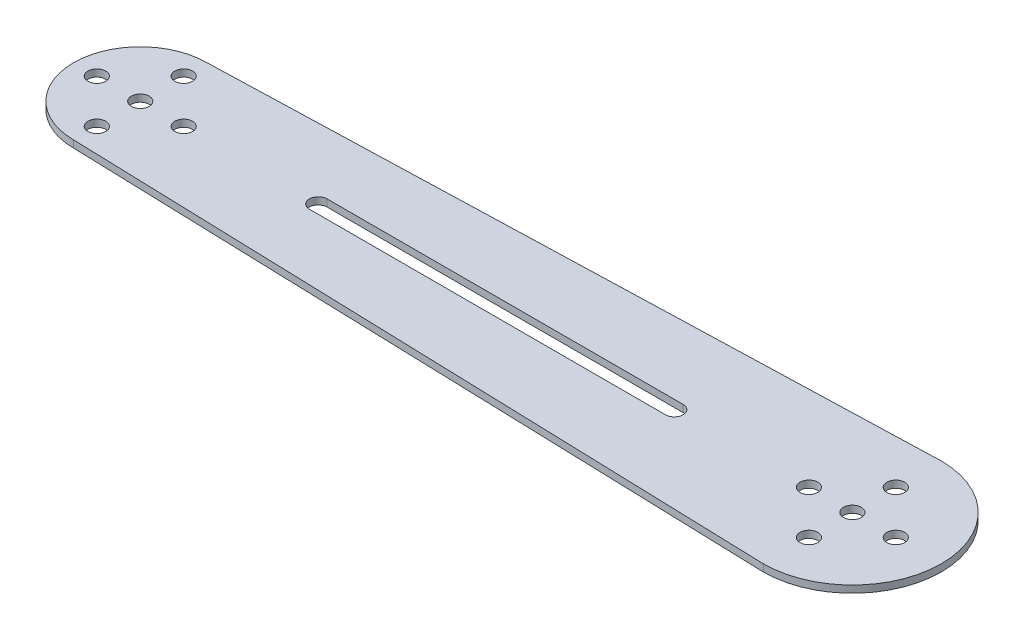
ISO-10303-21;
HEADER;
FILE_DESCRIPTION(('STEP AP214'),'2;1');
FILE_NAME('part.step','',(''),(''),'','','');
FILE_SCHEMA(('AUTOMOTIVE_DESIGN { 1 0 10303 214 1 1 1 1 }'));
ENDSEC;
DATA;
#1=APPLICATION_CONTEXT('core data for automotive mechanical design processes');
#2=APPLICATION_PROTOCOL_DEFINITION('international standard','automotive_design',2000,#1);
#3=PRODUCT_CONTEXT('',#1,'mechanical');
#4=PRODUCT('Part','Part','',(#3));
#5=PRODUCT_RELATED_PRODUCT_CATEGORY('part','',(#4));
#6=PRODUCT_DEFINITION_FORMATION('','',#4);
#7=PRODUCT_DEFINITION_CONTEXT('part definition',#1,'design');
#8=PRODUCT_DEFINITION('design','',#6,#7);
#9=PRODUCT_DEFINITION_SHAPE('','',#8);
#10=(LENGTH_UNIT() NAMED_UNIT(*) SI_UNIT(.MILLI.,.METRE.));
#11=(NAMED_UNIT(*) PLANE_ANGLE_UNIT() SI_UNIT($,.RADIAN.));
#12=(NAMED_UNIT(*) SI_UNIT($,.STERADIAN.) SOLID_ANGLE_UNIT());
#13=UNCERTAINTY_MEASURE_WITH_UNIT(LENGTH_MEASURE(1.E-05),#10,'distance_accuracy_value','');
#14=(GEOMETRIC_REPRESENTATION_CONTEXT(3) GLOBAL_UNCERTAINTY_ASSIGNED_CONTEXT((#13)) GLOBAL_UNIT_ASSIGNED_CONTEXT((#10,
#11,#12)) REPRESENTATION_CONTEXT('',''));
#15=CARTESIAN_POINT('',(0.,0.,0.));
#16=DIRECTION('',(0.,0.,1.));
#17=DIRECTION('',(1.,0.,0.));
#18=AXIS2_PLACEMENT_3D('',#15,#16,#17);
#19=CARTESIAN_POINT('',(100.,2.,0.));
#20=DIRECTION('',(0.,-1.,0.));
#21=DIRECTION('',(0.,0.,-1.));
#22=AXIS2_PLACEMENT_3D('',#19,#20,#21);
#23=CYLINDRICAL_SURFACE('',#22,25.);
#24=CARTESIAN_POINT('',(100.,0.,0.));
#25=DIRECTION('',(0.,1.,0.));
#26=DIRECTION('',(0.,0.,1.));
#27=AXIS2_PLACEMENT_3D('',#24,#25,#26);
#28=CIRCLE('',#27,25.);
#29=CARTESIAN_POINT('',(100.,0.,25.));
#30=VERTEX_POINT('',#29);
#31=CARTESIAN_POINT('',(100.,0.,-25.));
#32=VERTEX_POINT('',#31);
#33=EDGE_CURVE('E192',#30,#32,#28,.T.);
#34=ORIENTED_EDGE('',*,*,#33,.T.);
#35=DIRECTION('',(0.,-1.,0.));
#36=VECTOR('',#35,1.);
#37=CARTESIAN_POINT('',(100.,2.,-25.));
#38=LINE('',#37,#36);
#39=CARTESIAN_POINT('',(100.,2.,-25.));
#40=VERTEX_POINT('',#39);
#41=EDGE_CURVE('E11',#40,#32,#38,.T.);
#42=ORIENTED_EDGE('',*,*,#41,.F.);
#43=CARTESIAN_POINT('',(100.,2.,0.));
#44=DIRECTION('',(0.,1.,0.));
#45=DIRECTION('',(0.,0.,1.));
#46=AXIS2_PLACEMENT_3D('',#43,#44,#45);
#47=CIRCLE('',#46,25.);
#48=CARTESIAN_POINT('',(100.,2.,25.));
#49=VERTEX_POINT('',#48);
#50=EDGE_CURVE('E193',#49,#40,#47,.T.);
#51=ORIENTED_EDGE('',*,*,#50,.F.);
#52=DIRECTION('',(0.,-1.,0.));
#53=VECTOR('',#52,1.);
#54=CARTESIAN_POINT('',(100.,2.,25.));
#55=LINE('',#54,#53);
#56=EDGE_CURVE('E203',#49,#30,#55,.T.);
#57=ORIENTED_EDGE('',*,*,#56,.T.);
#58=EDGE_LOOP('',(#34,#42,#51,#57));
#59=FACE_BOUND('',#58,.T.);
#60=ADVANCED_FACE('F32',(#59),#23,.T.);
#61=CARTESIAN_POINT('',(100.,2.,-25.));
#62=DIRECTION('',(0.0312347523777212,0.,0.999512076087079));
#63=DIRECTION('',(0.999512076087079,0.,-0.0312347523777212));
#64=AXIS2_PLACEMENT_3D('',#61,#62,#63);
#65=PLANE('',#64);
#66=DIRECTION('',(-0.999512076087079,0.,0.0312347523777212));
#67=VECTOR('',#66,1.);
#68=CARTESIAN_POINT('',(100.,0.,-25.));
#69=LINE('',#68,#67);
#70=CARTESIAN_POINT('',(-100.,0.,-18.75));
#71=VERTEX_POINT('',#70);
#72=EDGE_CURVE('E206',#32,#71,#69,.T.);
#73=ORIENTED_EDGE('',*,*,#72,.T.);
#74=DIRECTION('',(0.,-1.,0.));
#75=VECTOR('',#74,1.);
#76=CARTESIAN_POINT('',(-100.,2.,-18.75));
#77=LINE('',#76,#75);
#78=CARTESIAN_POINT('',(-100.,2.,-18.75));
#79=VERTEX_POINT('',#78);
#80=EDGE_CURVE('E39',#79,#71,#77,.T.);
#81=ORIENTED_EDGE('',*,*,#80,.F.);
#82=DIRECTION('',(-0.999512076087079,0.,0.0312347523777212));
#83=VECTOR('',#82,1.);
#84=CARTESIAN_POINT('',(100.,2.,-25.));
#85=LINE('',#84,#83);
#86=EDGE_CURVE('E196',#40,#79,#85,.T.);
#87=ORIENTED_EDGE('',*,*,#86,.F.);
#88=ORIENTED_EDGE('',*,*,#41,.T.);
#89=EDGE_LOOP('',(#73,#81,#87,#88));
#90=FACE_BOUND('',#89,.T.);
#91=ADVANCED_FACE('F235',(#90),#65,.F.);
#92=CARTESIAN_POINT('',(-100.,2.,0.));
#93=DIRECTION('',(0.,-1.,0.));
#94=DIRECTION('',(0.,0.,-1.));
#95=AXIS2_PLACEMENT_3D('',#92,#93,#94);
#96=CYLINDRICAL_SURFACE('',#95,18.75);
#97=CARTESIAN_POINT('',(-100.,0.,0.));
#98=DIRECTION('',(0.,1.,0.));
#99=DIRECTION('',(0.,0.,1.));
#100=AXIS2_PLACEMENT_3D('',#97,#98,#99);
#101=CIRCLE('',#100,18.75);
#102=CARTESIAN_POINT('',(-100.,0.,18.75));
#103=VERTEX_POINT('',#102);
#104=EDGE_CURVE('E208',#71,#103,#101,.T.);
#105=ORIENTED_EDGE('',*,*,#104,.T.);
#106=DIRECTION('',(0.,-1.,0.));
#107=VECTOR('',#106,1.);
#108=CARTESIAN_POINT('',(-100.,2.,18.75));
#109=LINE('',#108,#107);
#110=CARTESIAN_POINT('',(-100.,2.,18.75));
#111=VERTEX_POINT('',#110);
#112=EDGE_CURVE('E213',#111,#103,#109,.T.);
#113=ORIENTED_EDGE('',*,*,#112,.F.);
#114=CARTESIAN_POINT('',(-100.,2.,0.));
#115=DIRECTION('',(0.,1.,0.));
#116=DIRECTION('',(0.,0.,1.));
#117=AXIS2_PLACEMENT_3D('',#114,#115,#116);
#118=CIRCLE('',#117,18.75);
#119=EDGE_CURVE('E199',#79,#111,#118,.T.);
#120=ORIENTED_EDGE('',*,*,#119,.F.);
#121=ORIENTED_EDGE('',*,*,#80,.T.);
#122=EDGE_LOOP('',(#105,#113,#120,#121));
#123=FACE_BOUND('',#122,.T.);
#124=ADVANCED_FACE('F220',(#123),#96,.T.);
#125=CARTESIAN_POINT('',(100.,2.,25.));
#126=DIRECTION('',(0.0312347523777212,0.,-0.999512076087079));
#127=DIRECTION('',(-0.999512076087079,0.,-0.0312347523777212));
#128=AXIS2_PLACEMENT_3D('',#125,#126,#127);
#129=PLANE('',#128);
#130=DIRECTION('',(0.999512076087079,0.,0.0312347523777212));
#131=VECTOR('',#130,1.);
#132=CARTESIAN_POINT('',(100.,0.,25.));
#133=LINE('',#132,#131);
#134=EDGE_CURVE('E197',#103,#30,#133,.T.);
#135=ORIENTED_EDGE('',*,*,#134,.T.);
#136=ORIENTED_EDGE('',*,*,#56,.F.);
#137=DIRECTION('',(0.999512076087079,0.,0.0312347523777212));
#138=VECTOR('',#137,1.);
#139=CARTESIAN_POINT('',(100.,2.,25.));
#140=LINE('',#139,#138);
#141=EDGE_CURVE('E201',#111,#49,#140,.T.);
#142=ORIENTED_EDGE('',*,*,#141,.F.);
#143=ORIENTED_EDGE('',*,*,#112,.T.);
#144=EDGE_LOOP('',(#135,#136,#142,#143));
#145=FACE_BOUND('',#144,.T.);
#146=ADVANCED_FACE('F228',(#145),#129,.F.);
#147=CARTESIAN_POINT('',(100.,2.,0.));
#148=DIRECTION('',(0.,1.,0.));
#149=DIRECTION('',(0.,0.,1.));
#150=AXIS2_PLACEMENT_3D('',#147,#148,#149);
#151=PLANE('',#150);
#152=CARTESIAN_POINT('',(-50.,2.,0.));
#153=DIRECTION('',(0.,1.,0.));
#154=DIRECTION('',(0.,0.,1.));
#155=AXIS2_PLACEMENT_3D('',#152,#153,#154);
#156=CIRCLE('',#155,2.49999999999999);
#157=CARTESIAN_POINT('',(-50.,2.,-2.49999999999999));
#158=VERTEX_POINT('',#157);
#159=CARTESIAN_POINT('',(-50.,2.,2.49999999999999));
#160=VERTEX_POINT('',#159);
#161=EDGE_CURVE('E46',#158,#160,#156,.T.);
#162=ORIENTED_EDGE('',*,*,#161,.F.);
#163=DIRECTION('',(-1.,0.,0.));
#164=VECTOR('',#163,1.);
#165=CARTESIAN_POINT('',(-50.,2.,-2.49999999999999));
#166=LINE('',#165,#164);
#167=CARTESIAN_POINT('',(50.,2.,-2.5));
#168=VERTEX_POINT('',#167);
#169=EDGE_CURVE('E104',#168,#158,#166,.T.);
#170=ORIENTED_EDGE('',*,*,#169,.F.);
#171=CARTESIAN_POINT('',(50.,2.,0.));
#172=DIRECTION('',(0.,1.,0.));
#173=DIRECTION('',(0.,0.,1.));
#174=AXIS2_PLACEMENT_3D('',#171,#172,#173);
#175=CIRCLE('',#174,2.49999999999999);
#176=CARTESIAN_POINT('',(50.,2.,2.49999999999998));
#177=VERTEX_POINT('',#176);
#178=EDGE_CURVE('E124',#177,#168,#175,.T.);
#179=ORIENTED_EDGE('',*,*,#178,.F.);
#180=DIRECTION('',(1.,0.,0.));
#181=VECTOR('',#180,1.);
#182=CARTESIAN_POINT('',(-50.,2.,2.49999999999999));
#183=LINE('',#182,#181);
#184=EDGE_CURVE('E118',#160,#177,#183,.T.);
#185=ORIENTED_EDGE('',*,*,#184,.F.);
#186=EDGE_LOOP('',(#162,#170,#179,#185));
#187=FACE_BOUND('',#186,.T.);
#188=CARTESIAN_POINT('',(100.,2.,12.2));
#189=DIRECTION('',(0.,1.,0.));
#190=DIRECTION('',(0.,0.,1.));
#191=AXIS2_PLACEMENT_3D('',#188,#189,#190);
#192=CIRCLE('',#191,2.49999999999999);
#193=CARTESIAN_POINT('',(100.,2.,14.7));
#194=VERTEX_POINT('',#193);
#195=EDGE_CURVE('E151',#194,#194,#192,.T.);
#196=ORIENTED_EDGE('',*,*,#195,.F.);
#197=EDGE_LOOP('',(#196));
#198=FACE_BOUND('',#197,.T.);
#199=CARTESIAN_POINT('',(112.2,2.,0.));
#200=DIRECTION('',(0.,1.,0.));
#201=DIRECTION('',(0.,0.,1.));
#202=AXIS2_PLACEMENT_3D('',#199,#200,#201);
#203=CIRCLE('',#202,2.5);
#204=CARTESIAN_POINT('',(112.2,2.,2.5));
#205=VERTEX_POINT('',#204);
#206=EDGE_CURVE('E159',#205,#205,#203,.T.);
#207=ORIENTED_EDGE('',*,*,#206,.F.);
#208=EDGE_LOOP('',(#207));
#209=FACE_BOUND('',#208,.T.);
#210=CARTESIAN_POINT('',(87.8,2.,0.));
#211=DIRECTION('',(0.,1.,0.));
#212=DIRECTION('',(0.,0.,1.));
#213=AXIS2_PLACEMENT_3D('',#210,#211,#212);
#214=CIRCLE('',#213,2.49999999999999);
#215=CARTESIAN_POINT('',(87.8,2.,2.49999999999999));
#216=VERTEX_POINT('',#215);
#217=EDGE_CURVE('E165',#216,#216,#214,.T.);
#218=ORIENTED_EDGE('',*,*,#217,.F.);
#219=EDGE_LOOP('',(#218));
#220=FACE_BOUND('',#219,.T.);
#221=CARTESIAN_POINT('',(-100.,2.,-12.2));
#222=DIRECTION('',(0.,1.,0.));
#223=DIRECTION('',(0.,0.,1.));
#224=AXIS2_PLACEMENT_3D('',#221,#222,#223);
#225=CIRCLE('',#224,2.5);
#226=CARTESIAN_POINT('',(-100.,2.,-9.7));
#227=VERTEX_POINT('',#226);
#228=EDGE_CURVE('E140',#227,#227,#225,.T.);
#229=ORIENTED_EDGE('',*,*,#228,.F.);
#230=EDGE_LOOP('',(#229));
#231=FACE_BOUND('',#230,.T.);
#232=CARTESIAN_POINT('',(-87.8,2.,0.));
#233=DIRECTION('',(0.,1.,0.));
#234=DIRECTION('',(0.,0.,1.));
#235=AXIS2_PLACEMENT_3D('',#232,#233,#234);
#236=CIRCLE('',#235,2.50000000000001);
#237=CARTESIAN_POINT('',(-87.8,2.,2.50000000000001));
#238=VERTEX_POINT('',#237);
#239=EDGE_CURVE('E133',#238,#238,#236,.T.);
#240=ORIENTED_EDGE('',*,*,#239,.F.);
#241=EDGE_LOOP('',(#240));
#242=FACE_BOUND('',#241,.T.);
#243=CARTESIAN_POINT('',(-112.2,2.,0.));
#244=DIRECTION('',(0.,1.,0.));
#245=DIRECTION('',(0.,0.,1.));
#246=AXIS2_PLACEMENT_3D('',#243,#244,#245);
#247=CIRCLE('',#246,2.49999999999999);
#248=CARTESIAN_POINT('',(-112.2,2.,2.5));
#249=VERTEX_POINT('',#248);
#250=EDGE_CURVE('E141',#249,#249,#247,.T.);
#251=ORIENTED_EDGE('',*,*,#250,.F.);
#252=EDGE_LOOP('',(#251));
#253=FACE_BOUND('',#252,.T.);
#254=CARTESIAN_POINT('',(-100.,2.,12.2));
#255=DIRECTION('',(0.,1.,0.));
#256=DIRECTION('',(0.,0.,1.));
#257=AXIS2_PLACEMENT_3D('',#254,#255,#256);
#258=CIRCLE('',#257,2.5);
#259=CARTESIAN_POINT('',(-100.,2.,14.7));
#260=VERTEX_POINT('',#259);
#261=EDGE_CURVE('E110',#260,#260,#258,.T.);
#262=ORIENTED_EDGE('',*,*,#261,.F.);
#263=EDGE_LOOP('',(#262));
#264=FACE_BOUND('',#263,.T.);
#265=CARTESIAN_POINT('',(100.,2.,-12.2));
#266=DIRECTION('',(0.,1.,0.));
#267=DIRECTION('',(0.,0.,1.));
#268=AXIS2_PLACEMENT_3D('',#265,#266,#267);
#269=CIRCLE('',#268,2.5);
#270=CARTESIAN_POINT('',(100.,2.,-9.7));
#271=VERTEX_POINT('',#270);
#272=EDGE_CURVE('E158',#271,#271,#269,.T.);
#273=ORIENTED_EDGE('',*,*,#272,.F.);
#274=EDGE_LOOP('',(#273));
#275=FACE_BOUND('',#274,.T.);
#276=CARTESIAN_POINT('',(100.,2.,0.));
#277=DIRECTION('',(0.,1.,0.));
#278=DIRECTION('',(0.,0.,1.));
#279=AXIS2_PLACEMENT_3D('',#276,#277,#278);
#280=CIRCLE('',#279,2.5);
#281=CARTESIAN_POINT('',(100.,2.,2.49999999999997));
#282=VERTEX_POINT('',#281);
#283=EDGE_CURVE('E180',#282,#282,#280,.T.);
#284=ORIENTED_EDGE('',*,*,#283,.F.);
#285=EDGE_LOOP('',(#284));
#286=FACE_BOUND('',#285,.T.);
#287=CARTESIAN_POINT('',(-100.,2.,0.));
#288=DIRECTION('',(0.,1.,0.));
#289=DIRECTION('',(0.,0.,1.));
#290=AXIS2_PLACEMENT_3D('',#287,#288,#289);
#291=CIRCLE('',#290,2.5);
#292=CARTESIAN_POINT('',(-100.,2.,2.5));
#293=VERTEX_POINT('',#292);
#294=EDGE_CURVE('E186',#293,#293,#291,.T.);
#295=ORIENTED_EDGE('',*,*,#294,.F.);
#296=EDGE_LOOP('',(#295));
#297=FACE_BOUND('',#296,.T.);
#298=ORIENTED_EDGE('',*,*,#50,.T.);
#299=ORIENTED_EDGE('',*,*,#86,.T.);
#300=ORIENTED_EDGE('',*,*,#119,.T.);
#301=ORIENTED_EDGE('',*,*,#141,.T.);
#302=EDGE_LOOP('',(#298,#299,#300,#301));
#303=FACE_BOUND('',#302,.T.);
#304=ADVANCED_FACE('F234',(#187,#198,#209,#220,#231,#242,#253,#264,#275,#286,#297,#303),#151,.T.);
#305=CARTESIAN_POINT('',(100.,0.,0.));
#306=DIRECTION('',(0.,1.,0.));
#307=DIRECTION('',(0.,0.,1.));
#308=AXIS2_PLACEMENT_3D('',#305,#306,#307);
#309=PLANE('',#308);
#310=DIRECTION('',(1.,0.,0.));
#311=VECTOR('',#310,1.);
#312=CARTESIAN_POINT('',(-50.,0.,-2.49999999999999));
#313=LINE('',#312,#311);
#314=CARTESIAN_POINT('',(-50.,0.,-2.49999999999999));
#315=VERTEX_POINT('',#314);
#316=CARTESIAN_POINT('',(50.,0.,-2.5));
#317=VERTEX_POINT('',#316);
#318=EDGE_CURVE('E116',#315,#317,#313,.T.);
#319=ORIENTED_EDGE('',*,*,#318,.F.);
#320=CARTESIAN_POINT('',(-50.,0.,0.));
#321=DIRECTION('',(0.,1.,0.));
#322=DIRECTION('',(0.,0.,1.));
#323=AXIS2_PLACEMENT_3D('',#320,#321,#322);
#324=CIRCLE('',#323,2.49999999999999);
#325=CARTESIAN_POINT('',(-50.,0.,2.49999999999999));
#326=VERTEX_POINT('',#325);
#327=EDGE_CURVE('E98',#326,#315,#324,.F.);
#328=ORIENTED_EDGE('',*,*,#327,.F.);
#329=DIRECTION('',(-1.,0.,0.));
#330=VECTOR('',#329,1.);
#331=CARTESIAN_POINT('',(-50.,0.,2.49999999999999));
#332=LINE('',#331,#330);
#333=CARTESIAN_POINT('',(50.,0.,2.49999999999998));
#334=VERTEX_POINT('',#333);
#335=EDGE_CURVE('E107',#334,#326,#332,.T.);
#336=ORIENTED_EDGE('',*,*,#335,.F.);
#337=CARTESIAN_POINT('',(50.,0.,0.));
#338=DIRECTION('',(0.,1.,0.));
#339=DIRECTION('',(0.,0.,1.));
#340=AXIS2_PLACEMENT_3D('',#337,#338,#339);
#341=CIRCLE('',#340,2.49999999999999);
#342=EDGE_CURVE('E54',#317,#334,#341,.F.);
#343=ORIENTED_EDGE('',*,*,#342,.F.);
#344=EDGE_LOOP('',(#319,#328,#336,#343));
#345=FACE_BOUND('',#344,.T.);
#346=CARTESIAN_POINT('',(100.,0.,12.2));
#347=DIRECTION('',(0.,1.,0.));
#348=DIRECTION('',(0.,0.,1.));
#349=AXIS2_PLACEMENT_3D('',#346,#347,#348);
#350=CIRCLE('',#349,2.49999999999999);
#351=CARTESIAN_POINT('',(100.,0.,14.7));
#352=VERTEX_POINT('',#351);
#353=EDGE_CURVE('E154',#352,#352,#350,.F.);
#354=ORIENTED_EDGE('',*,*,#353,.F.);
#355=EDGE_LOOP('',(#354));
#356=FACE_BOUND('',#355,.T.);
#357=CARTESIAN_POINT('',(112.2,0.,0.));
#358=DIRECTION('',(0.,1.,0.));
#359=DIRECTION('',(0.,0.,1.));
#360=AXIS2_PLACEMENT_3D('',#357,#358,#359);
#361=CIRCLE('',#360,2.5);
#362=CARTESIAN_POINT('',(112.2,0.,2.5));
#363=VERTEX_POINT('',#362);
#364=EDGE_CURVE('E155',#363,#363,#361,.F.);
#365=ORIENTED_EDGE('',*,*,#364,.F.);
#366=EDGE_LOOP('',(#365));
#367=FACE_BOUND('',#366,.T.);
#368=CARTESIAN_POINT('',(87.8,0.,0.));
#369=DIRECTION('',(0.,1.,0.));
#370=DIRECTION('',(0.,0.,1.));
#371=AXIS2_PLACEMENT_3D('',#368,#369,#370);
#372=CIRCLE('',#371,2.49999999999999);
#373=CARTESIAN_POINT('',(87.8,0.,2.49999999999999));
#374=VERTEX_POINT('',#373);
#375=EDGE_CURVE('E162',#374,#374,#372,.F.);
#376=ORIENTED_EDGE('',*,*,#375,.F.);
#377=EDGE_LOOP('',(#376));
#378=FACE_BOUND('',#377,.T.);
#379=CARTESIAN_POINT('',(-100.,0.,-12.2));
#380=DIRECTION('',(0.,1.,0.));
#381=DIRECTION('',(0.,0.,1.));
#382=AXIS2_PLACEMENT_3D('',#379,#380,#381);
#383=CIRCLE('',#382,2.5);
#384=CARTESIAN_POINT('',(-100.,0.,-9.7));
#385=VERTEX_POINT('',#384);
#386=EDGE_CURVE('E168',#385,#385,#383,.F.);
#387=ORIENTED_EDGE('',*,*,#386,.F.);
#388=EDGE_LOOP('',(#387));
#389=FACE_BOUND('',#388,.T.);
#390=CARTESIAN_POINT('',(-87.8,0.,0.));
#391=DIRECTION('',(0.,1.,0.));
#392=DIRECTION('',(0.,0.,1.));
#393=AXIS2_PLACEMENT_3D('',#390,#391,#392);
#394=CIRCLE('',#393,2.50000000000001);
#395=CARTESIAN_POINT('',(-87.8,0.,2.50000000000001));
#396=VERTEX_POINT('',#395);
#397=EDGE_CURVE('E136',#396,#396,#394,.F.);
#398=ORIENTED_EDGE('',*,*,#397,.F.);
#399=EDGE_LOOP('',(#398));
#400=FACE_BOUND('',#399,.T.);
#401=CARTESIAN_POINT('',(-112.2,0.,0.));
#402=DIRECTION('',(0.,1.,0.));
#403=DIRECTION('',(0.,0.,1.));
#404=AXIS2_PLACEMENT_3D('',#401,#402,#403);
#405=CIRCLE('',#404,2.49999999999999);
#406=CARTESIAN_POINT('',(-112.2,0.,2.5));
#407=VERTEX_POINT('',#406);
#408=EDGE_CURVE('E137',#407,#407,#405,.F.);
#409=ORIENTED_EDGE('',*,*,#408,.F.);
#410=EDGE_LOOP('',(#409));
#411=FACE_BOUND('',#410,.T.);
#412=CARTESIAN_POINT('',(-100.,0.,12.2));
#413=DIRECTION('',(0.,1.,0.));
#414=DIRECTION('',(0.,0.,1.));
#415=AXIS2_PLACEMENT_3D('',#412,#413,#414);
#416=CIRCLE('',#415,2.5);
#417=CARTESIAN_POINT('',(-100.,0.,14.7));
#418=VERTEX_POINT('',#417);
#419=EDGE_CURVE('E144',#418,#418,#416,.F.);
#420=ORIENTED_EDGE('',*,*,#419,.F.);
#421=EDGE_LOOP('',(#420));
#422=FACE_BOUND('',#421,.T.);
#423=CARTESIAN_POINT('',(100.,0.,-12.2));
#424=DIRECTION('',(0.,1.,0.));
#425=DIRECTION('',(0.,0.,1.));
#426=AXIS2_PLACEMENT_3D('',#423,#424,#425);
#427=CIRCLE('',#426,2.5);
#428=CARTESIAN_POINT('',(100.,0.,-9.7));
#429=VERTEX_POINT('',#428);
#430=EDGE_CURVE('E177',#429,#429,#427,.F.);
#431=ORIENTED_EDGE('',*,*,#430,.F.);
#432=EDGE_LOOP('',(#431));
#433=FACE_BOUND('',#432,.T.);
#434=CARTESIAN_POINT('',(100.,0.,0.));
#435=DIRECTION('',(0.,1.,0.));
#436=DIRECTION('',(0.,0.,1.));
#437=AXIS2_PLACEMENT_3D('',#434,#435,#436);
#438=CIRCLE('',#437,2.5);
#439=CARTESIAN_POINT('',(100.,0.,2.49999999999997));
#440=VERTEX_POINT('',#439);
#441=EDGE_CURVE('E183',#440,#440,#438,.T.);
#442=ORIENTED_EDGE('',*,*,#441,.T.);
#443=EDGE_LOOP('',(#442));
#444=FACE_BOUND('',#443,.T.);
#445=CARTESIAN_POINT('',(-100.,0.,0.));
#446=DIRECTION('',(0.,1.,0.));
#447=DIRECTION('',(0.,0.,1.));
#448=AXIS2_PLACEMENT_3D('',#445,#446,#447);
#449=CIRCLE('',#448,2.5);
#450=CARTESIAN_POINT('',(-100.,0.,2.5));
#451=VERTEX_POINT('',#450);
#452=EDGE_CURVE('E189',#451,#451,#449,.T.);
#453=ORIENTED_EDGE('',*,*,#452,.T.);
#454=EDGE_LOOP('',(#453));
#455=FACE_BOUND('',#454,.T.);
#456=ORIENTED_EDGE('',*,*,#33,.F.);
#457=ORIENTED_EDGE('',*,*,#134,.F.);
#458=ORIENTED_EDGE('',*,*,#104,.F.);
#459=ORIENTED_EDGE('',*,*,#72,.F.);
#460=EDGE_LOOP('',(#456,#457,#458,#459));
#461=FACE_BOUND('',#460,.T.);
#462=ADVANCED_FACE('F113',(#345,#356,#367,#378,#389,#400,#411,#422,#433,#444,#455,#461),#309,.F.);
#463=CARTESIAN_POINT('',(-100.,2.,0.));
#464=DIRECTION('',(0.,1.,0.));
#465=DIRECTION('',(0.,0.,1.));
#466=AXIS2_PLACEMENT_3D('',#463,#464,#465);
#467=CYLINDRICAL_SURFACE('',#466,2.5);
#468=ORIENTED_EDGE('',*,*,#452,.F.);
#469=EDGE_LOOP('',(#468));
#470=FACE_BOUND('',#469,.T.);
#471=ORIENTED_EDGE('',*,*,#294,.T.);
#472=EDGE_LOOP('',(#471));
#473=FACE_BOUND('',#472,.T.);
#474=ADVANCED_FACE('F247',(#470,#473),#467,.F.);
#475=CARTESIAN_POINT('',(100.,2.,0.));
#476=DIRECTION('',(0.,1.,0.));
#477=DIRECTION('',(0.,0.,1.));
#478=AXIS2_PLACEMENT_3D('',#475,#476,#477);
#479=CYLINDRICAL_SURFACE('',#478,2.5);
#480=ORIENTED_EDGE('',*,*,#441,.F.);
#481=EDGE_LOOP('',(#480));
#482=FACE_BOUND('',#481,.T.);
#483=ORIENTED_EDGE('',*,*,#283,.T.);
#484=EDGE_LOOP('',(#483));
#485=FACE_BOUND('',#484,.T.);
#486=ADVANCED_FACE('F253',(#482,#485),#479,.F.);
#487=CARTESIAN_POINT('',(100.,-0.00100000000000013,-12.2));
#488=DIRECTION('',(0.,1.,0.));
#489=DIRECTION('',(0.,0.,1.));
#490=AXIS2_PLACEMENT_3D('',#487,#488,#489);
#491=CYLINDRICAL_SURFACE('',#490,2.5);
#492=ORIENTED_EDGE('',*,*,#272,.T.);
#493=EDGE_LOOP('',(#492));
#494=FACE_BOUND('',#493,.T.);
#495=ORIENTED_EDGE('',*,*,#430,.T.);
#496=EDGE_LOOP('',(#495));
#497=FACE_BOUND('',#496,.T.);
#498=ADVANCED_FACE('F257',(#494,#497),#491,.F.);
#499=CARTESIAN_POINT('',(-100.,-0.00100000000000013,12.2));
#500=DIRECTION('',(0.,1.,0.));
#501=DIRECTION('',(0.,0.,1.));
#502=AXIS2_PLACEMENT_3D('',#499,#500,#501);
#503=CYLINDRICAL_SURFACE('',#502,2.5);
#504=ORIENTED_EDGE('',*,*,#261,.T.);
#505=EDGE_LOOP('',(#504));
#506=FACE_BOUND('',#505,.T.);
#507=ORIENTED_EDGE('',*,*,#419,.T.);
#508=EDGE_LOOP('',(#507));
#509=FACE_BOUND('',#508,.T.);
#510=ADVANCED_FACE('F261',(#506,#509),#503,.F.);
#511=CARTESIAN_POINT('',(-112.2,-0.00100000000000013,0.));
#512=DIRECTION('',(0.,1.,0.));
#513=DIRECTION('',(0.,0.,1.));
#514=AXIS2_PLACEMENT_3D('',#511,#512,#513);
#515=CYLINDRICAL_SURFACE('',#514,2.49999999999999);
#516=ORIENTED_EDGE('',*,*,#250,.T.);
#517=EDGE_LOOP('',(#516));
#518=FACE_BOUND('',#517,.T.);
#519=ORIENTED_EDGE('',*,*,#408,.T.);
#520=EDGE_LOOP('',(#519));
#521=FACE_BOUND('',#520,.T.);
#522=ADVANCED_FACE('F282',(#518,#521),#515,.F.);
#523=CARTESIAN_POINT('',(-87.8,-0.00100000000000013,0.));
#524=DIRECTION('',(0.,1.,0.));
#525=DIRECTION('',(0.,0.,1.));
#526=AXIS2_PLACEMENT_3D('',#523,#524,#525);
#527=CYLINDRICAL_SURFACE('',#526,2.50000000000001);
#528=ORIENTED_EDGE('',*,*,#239,.T.);
#529=EDGE_LOOP('',(#528));
#530=FACE_BOUND('',#529,.T.);
#531=ORIENTED_EDGE('',*,*,#397,.T.);
#532=EDGE_LOOP('',(#531));
#533=FACE_BOUND('',#532,.T.);
#534=ADVANCED_FACE('F267',(#530,#533),#527,.F.);
#535=CARTESIAN_POINT('',(-100.,-0.00100000000000013,-12.2));
#536=DIRECTION('',(0.,1.,0.));
#537=DIRECTION('',(0.,0.,1.));
#538=AXIS2_PLACEMENT_3D('',#535,#536,#537);
#539=CYLINDRICAL_SURFACE('',#538,2.5);
#540=ORIENTED_EDGE('',*,*,#228,.T.);
#541=EDGE_LOOP('',(#540));
#542=FACE_BOUND('',#541,.T.);
#543=ORIENTED_EDGE('',*,*,#386,.T.);
#544=EDGE_LOOP('',(#543));
#545=FACE_BOUND('',#544,.T.);
#546=ADVANCED_FACE('F263',(#542,#545),#539,.F.);
#547=CARTESIAN_POINT('',(87.8,-0.00100000000000013,0.));
#548=DIRECTION('',(0.,1.,0.));
#549=DIRECTION('',(0.,0.,1.));
#550=AXIS2_PLACEMENT_3D('',#547,#548,#549);
#551=CYLINDRICAL_SURFACE('',#550,2.49999999999999);
#552=ORIENTED_EDGE('',*,*,#217,.T.);
#553=EDGE_LOOP('',(#552));
#554=FACE_BOUND('',#553,.T.);
#555=ORIENTED_EDGE('',*,*,#375,.T.);
#556=EDGE_LOOP('',(#555));
#557=FACE_BOUND('',#556,.T.);
#558=ADVANCED_FACE('F266',(#554,#557),#551,.F.);
#559=CARTESIAN_POINT('',(112.2,-0.00100000000000013,0.));
#560=DIRECTION('',(0.,1.,0.));
#561=DIRECTION('',(0.,0.,1.));
#562=AXIS2_PLACEMENT_3D('',#559,#560,#561);
#563=CYLINDRICAL_SURFACE('',#562,2.5);
#564=ORIENTED_EDGE('',*,*,#206,.T.);
#565=EDGE_LOOP('',(#564));
#566=FACE_BOUND('',#565,.T.);
#567=ORIENTED_EDGE('',*,*,#364,.T.);
#568=EDGE_LOOP('',(#567));
#569=FACE_BOUND('',#568,.T.);
#570=ADVANCED_FACE('F271',(#566,#569),#563,.F.);
#571=CARTESIAN_POINT('',(100.,-0.00100000000000013,12.2));
#572=DIRECTION('',(0.,1.,0.));
#573=DIRECTION('',(0.,0.,1.));
#574=AXIS2_PLACEMENT_3D('',#571,#572,#573);
#575=CYLINDRICAL_SURFACE('',#574,2.49999999999999);
#576=ORIENTED_EDGE('',*,*,#195,.T.);
#577=EDGE_LOOP('',(#576));
#578=FACE_BOUND('',#577,.T.);
#579=ORIENTED_EDGE('',*,*,#353,.T.);
#580=EDGE_LOOP('',(#579));
#581=FACE_BOUND('',#580,.T.);
#582=ADVANCED_FACE('F275',(#578,#581),#575,.F.);
#583=CARTESIAN_POINT('',(-50.,-0.00100000000000013,0.));
#584=DIRECTION('',(0.,1.,0.));
#585=DIRECTION('',(0.,0.,1.));
#586=AXIS2_PLACEMENT_3D('',#583,#584,#585);
#587=CYLINDRICAL_SURFACE('',#586,2.49999999999999);
#588=ORIENTED_EDGE('',*,*,#327,.T.);
#589=DIRECTION('',(0.,1.,0.));
#590=VECTOR('',#589,1.);
#591=CARTESIAN_POINT('',(-50.,-0.00100000000000013,-2.49999999999999));
#592=LINE('',#591,#590);
#593=EDGE_CURVE('E111',#315,#158,#592,.T.);
#594=ORIENTED_EDGE('',*,*,#593,.T.);
#595=ORIENTED_EDGE('',*,*,#161,.T.);
#596=DIRECTION('',(0.,1.,0.));
#597=VECTOR('',#596,1.);
#598=CARTESIAN_POINT('',(-50.,-0.00100000000000013,2.49999999999999));
#599=LINE('',#598,#597);
#600=EDGE_CURVE('E94',#326,#160,#599,.T.);
#601=ORIENTED_EDGE('',*,*,#600,.F.);
#602=EDGE_LOOP('',(#588,#594,#595,#601));
#603=FACE_BOUND('',#602,.T.);
#604=ADVANCED_FACE('F96',(#603),#587,.F.);
#605=CARTESIAN_POINT('',(-50.,-0.00100000000000013,-2.49999999999999));
#606=DIRECTION('',(0.,0.,-1.));
#607=DIRECTION('',(-1.,0.,0.));
#608=AXIS2_PLACEMENT_3D('',#605,#606,#607);
#609=PLANE('',#608);
#610=ORIENTED_EDGE('',*,*,#318,.T.);
#611=DIRECTION('',(0.,1.,0.));
#612=VECTOR('',#611,1.);
#613=CARTESIAN_POINT('',(50.,-0.00100000000000013,-2.5));
#614=LINE('',#613,#612);
#615=EDGE_CURVE('E130',#317,#168,#614,.T.);
#616=ORIENTED_EDGE('',*,*,#615,.T.);
#617=ORIENTED_EDGE('',*,*,#169,.T.);
#618=ORIENTED_EDGE('',*,*,#593,.F.);
#619=EDGE_LOOP('',(#610,#616,#617,#618));
#620=FACE_BOUND('',#619,.T.);
#621=ADVANCED_FACE('F292',(#620),#609,.F.);
#622=CARTESIAN_POINT('',(50.,-0.00100000000000013,0.));
#623=DIRECTION('',(0.,1.,0.));
#624=DIRECTION('',(0.,0.,1.));
#625=AXIS2_PLACEMENT_3D('',#622,#623,#624);
#626=CYLINDRICAL_SURFACE('',#625,2.49999999999999);
#627=ORIENTED_EDGE('',*,*,#342,.T.);
#628=DIRECTION('',(0.,1.,0.));
#629=VECTOR('',#628,1.);
#630=CARTESIAN_POINT('',(50.,-0.00100000000000013,2.49999999999998));
#631=LINE('',#630,#629);
#632=EDGE_CURVE('E103',#334,#177,#631,.T.);
#633=ORIENTED_EDGE('',*,*,#632,.T.);
#634=ORIENTED_EDGE('',*,*,#178,.T.);
#635=ORIENTED_EDGE('',*,*,#615,.F.);
#636=EDGE_LOOP('',(#627,#633,#634,#635));
#637=FACE_BOUND('',#636,.T.);
#638=ADVANCED_FACE('F295',(#637),#626,.F.);
#639=CARTESIAN_POINT('',(-50.,-0.00100000000000013,2.49999999999999));
#640=DIRECTION('',(0.,0.,1.));
#641=DIRECTION('',(1.,0.,0.));
#642=AXIS2_PLACEMENT_3D('',#639,#640,#641);
#643=PLANE('',#642);
#644=ORIENTED_EDGE('',*,*,#335,.T.);
#645=ORIENTED_EDGE('',*,*,#600,.T.);
#646=ORIENTED_EDGE('',*,*,#184,.T.);
#647=ORIENTED_EDGE('',*,*,#632,.F.);
#648=EDGE_LOOP('',(#644,#645,#646,#647));
#649=FACE_BOUND('',#648,.T.);
#650=ADVANCED_FACE('F108',(#649),#643,.F.);
#651=CLOSED_SHELL('',(#60,#91,#124,#146,#304,#462,#474,#486,#498,#510,#522,#534,#546,#558,#570,
#582,#604,#621,#638,#650));
#652=MANIFOLD_SOLID_BREP('B2',#651);
#653=ADVANCED_BREP_SHAPE_REPRESENTATION('',(#18,#652),#14);
#654=SHAPE_DEFINITION_REPRESENTATION(#9,#653);
ENDSEC;
END-ISO-10303-21;
